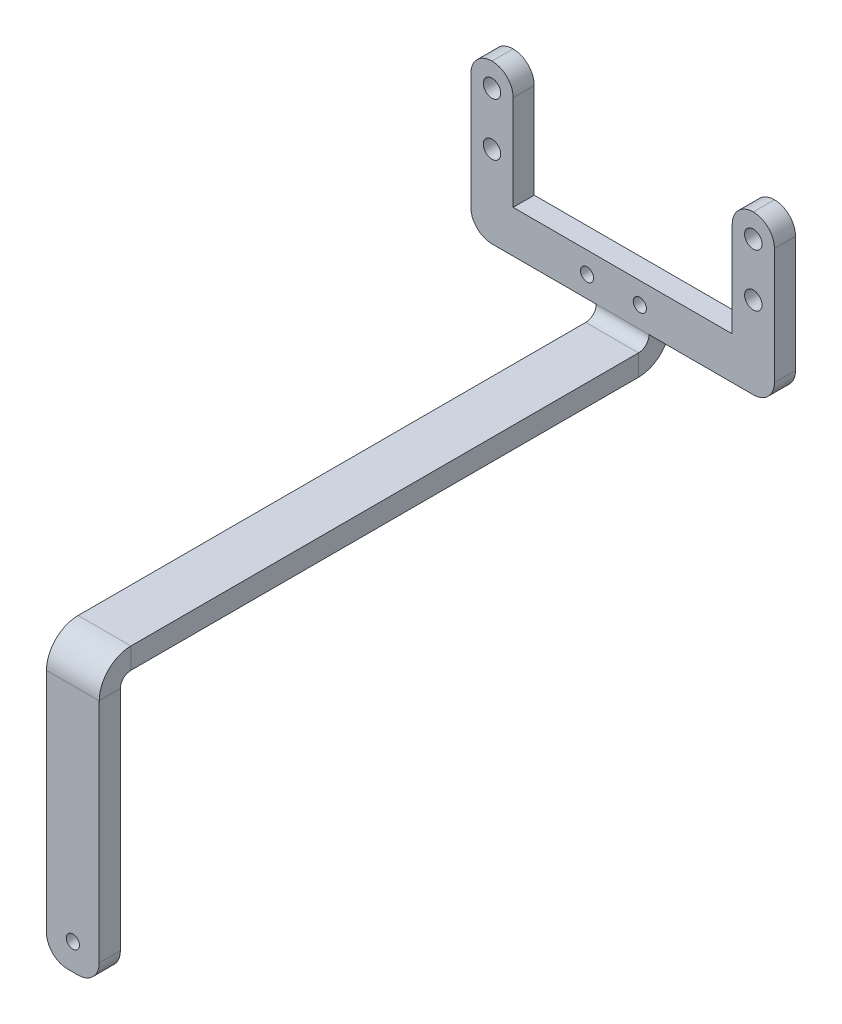
ISO-10303-21;
HEADER;
FILE_DESCRIPTION(('STEP AP214'),'2;1');
FILE_NAME('part.step','',(''),(''),'','','');
FILE_SCHEMA(('AUTOMOTIVE_DESIGN { 1 0 10303 214 1 1 1 1 }'));
ENDSEC;
DATA;
#1=APPLICATION_CONTEXT('core data for automotive mechanical design processes');
#2=APPLICATION_PROTOCOL_DEFINITION('international standard','automotive_design',2000,#1);
#3=PRODUCT_CONTEXT('',#1,'mechanical');
#4=PRODUCT('Part','Part','',(#3));
#5=PRODUCT_RELATED_PRODUCT_CATEGORY('part','',(#4));
#6=PRODUCT_DEFINITION_FORMATION('','',#4);
#7=PRODUCT_DEFINITION_CONTEXT('part definition',#1,'design');
#8=PRODUCT_DEFINITION('design','',#6,#7);
#9=PRODUCT_DEFINITION_SHAPE('','',#8);
#10=(LENGTH_UNIT() NAMED_UNIT(*) SI_UNIT(.MILLI.,.METRE.));
#11=(NAMED_UNIT(*) PLANE_ANGLE_UNIT() SI_UNIT($,.RADIAN.));
#12=(NAMED_UNIT(*) SI_UNIT($,.STERADIAN.) SOLID_ANGLE_UNIT());
#13=UNCERTAINTY_MEASURE_WITH_UNIT(LENGTH_MEASURE(1.E-05),#10,'distance_accuracy_value','');
#14=(GEOMETRIC_REPRESENTATION_CONTEXT(3) GLOBAL_UNCERTAINTY_ASSIGNED_CONTEXT((#13)) GLOBAL_UNIT_ASSIGNED_CONTEXT((#10,
#11,#12)) REPRESENTATION_CONTEXT('',''));
#15=CARTESIAN_POINT('',(0.,0.,0.));
#16=DIRECTION('',(0.,0.,1.));
#17=DIRECTION('',(1.,0.,0.));
#18=AXIS2_PLACEMENT_3D('',#15,#16,#17);
#19=CARTESIAN_POINT('',(23.75,-36.,3.99999999999999));
#20=DIRECTION('',(1.,0.,0.));
#21=DIRECTION('',(0.,0.,-1.));
#22=AXIS2_PLACEMENT_3D('',#19,#20,#21);
#23=PLANE('',#22);
#24=DIRECTION('',(0.,1.,0.));
#25=VECTOR('',#24,1.);
#26=CARTESIAN_POINT('',(23.75,-36.0000000000003,102.15));
#27=LINE('',#26,#25);
#28=CARTESIAN_POINT('',(23.75,-36.0000000000003,102.15));
#29=VERTEX_POINT('',#28);
#30=CARTESIAN_POINT('',(23.75,-32.0000000000003,102.15));
#31=VERTEX_POINT('',#30);
#32=EDGE_CURVE('E290',#29,#31,#27,.T.);
#33=ORIENTED_EDGE('',*,*,#32,.T.);
#34=DIRECTION('',(0.,0.,1.));
#35=VECTOR('',#34,1.);
#36=CARTESIAN_POINT('',(23.75,-32.,4.));
#37=LINE('',#36,#35);
#38=CARTESIAN_POINT('',(23.75,-32.,6.));
#39=VERTEX_POINT('',#38);
#40=EDGE_CURVE('E311',#31,#39,#37,.F.);
#41=ORIENTED_EDGE('',*,*,#40,.T.);
#42=DIRECTION('',(0.,1.,0.));
#43=VECTOR('',#42,1.);
#44=CARTESIAN_POINT('',(23.75,-36.,5.99999999999998));
#45=LINE('',#44,#43);
#46=CARTESIAN_POINT('',(23.75,-36.,5.99999999999998));
#47=VERTEX_POINT('',#46);
#48=EDGE_CURVE('E300',#39,#47,#45,.F.);
#49=ORIENTED_EDGE('',*,*,#48,.T.);
#50=DIRECTION('',(0.,0.,-1.));
#51=VECTOR('',#50,1.);
#52=CARTESIAN_POINT('',(23.75,-36.,-1.11778346024348E-13));
#53=LINE('',#52,#51);
#54=EDGE_CURVE('E306',#29,#47,#53,.T.);
#55=ORIENTED_EDGE('',*,*,#54,.F.);
#56=EDGE_LOOP('',(#33,#41,#49,#55));
#57=FACE_BOUND('',#56,.T.);
#58=ADVANCED_FACE('F77',(#57),#23,.F.);
#59=CARTESIAN_POINT('',(33.75,-36.0000000000004,108.15));
#60=DIRECTION('',(-1.,0.,0.));
#61=DIRECTION('',(0.,0.,1.));
#62=AXIS2_PLACEMENT_3D('',#59,#60,#61);
#63=PLANE('',#62);
#64=DIRECTION('',(0.,1.,0.));
#65=VECTOR('',#64,1.);
#66=CARTESIAN_POINT('',(33.75,-36.0000000000003,102.15));
#67=LINE('',#66,#65);
#68=CARTESIAN_POINT('',(33.75,-36.0000000000003,102.15));
#69=VERTEX_POINT('',#68);
#70=CARTESIAN_POINT('',(33.75,-32.0000000000003,102.15));
#71=VERTEX_POINT('',#70);
#72=EDGE_CURVE('E297',#69,#71,#67,.T.);
#73=ORIENTED_EDGE('',*,*,#72,.F.);
#74=DIRECTION('',(0.,0.,1.));
#75=VECTOR('',#74,1.);
#76=CARTESIAN_POINT('',(33.75,-36.,-1.14401667651485E-13));
#77=LINE('',#76,#75);
#78=CARTESIAN_POINT('',(33.75,-36.,5.99999999999999));
#79=VERTEX_POINT('',#78);
#80=EDGE_CURVE('E302',#79,#69,#77,.T.);
#81=ORIENTED_EDGE('',*,*,#80,.F.);
#82=DIRECTION('',(0.,1.,0.));
#83=VECTOR('',#82,1.);
#84=CARTESIAN_POINT('',(33.75,-32.,6.));
#85=LINE('',#84,#83);
#86=CARTESIAN_POINT('',(33.75,-32.,6.));
#87=VERTEX_POINT('',#86);
#88=EDGE_CURVE('E316',#87,#79,#85,.F.);
#89=ORIENTED_EDGE('',*,*,#88,.F.);
#90=DIRECTION('',(0.,0.,-1.));
#91=VECTOR('',#90,1.);
#92=CARTESIAN_POINT('',(33.75,-32.0000000000004,108.15));
#93=LINE('',#92,#91);
#94=EDGE_CURVE('E308',#87,#71,#93,.F.);
#95=ORIENTED_EDGE('',*,*,#94,.T.);
#96=EDGE_LOOP('',(#73,#81,#89,#95));
#97=FACE_BOUND('',#96,.T.);
#98=ADVANCED_FACE('F513',(#97),#63,.F.);
#99=CARTESIAN_POINT('',(0.,-36.,-1.18898790440863E-13));
#100=DIRECTION('',(0.,1.,0.));
#101=DIRECTION('',(0.,0.,1.));
#102=AXIS2_PLACEMENT_3D('',#99,#100,#101);
#103=PLANE('',#102);
#104=DIRECTION('',(-1.,0.,0.));
#105=VECTOR('',#104,1.);
#106=CARTESIAN_POINT('',(23.75,-36.0000000000003,102.15));
#107=LINE('',#106,#105);
#108=EDGE_CURVE('E294',#29,#69,#107,.F.);
#109=ORIENTED_EDGE('',*,*,#108,.F.);
#110=ORIENTED_EDGE('',*,*,#54,.T.);
#111=DIRECTION('',(1.,0.,0.));
#112=VECTOR('',#111,1.);
#113=CARTESIAN_POINT('',(23.75,-36.,5.99999999999998));
#114=LINE('',#113,#112);
#115=EDGE_CURVE('E313',#79,#47,#114,.F.);
#116=ORIENTED_EDGE('',*,*,#115,.F.);
#117=ORIENTED_EDGE('',*,*,#80,.T.);
#118=EDGE_LOOP('',(#109,#110,#116,#117));
#119=FACE_BOUND('',#118,.T.);
#120=ADVANCED_FACE('F508',(#119),#103,.F.);
#121=CARTESIAN_POINT('',(0.,-32.,-1.04932865085491E-13));
#122=DIRECTION('',(0.,1.,0.));
#123=DIRECTION('',(0.,0.,1.));
#124=AXIS2_PLACEMENT_3D('',#121,#122,#123);
#125=PLANE('',#124);
#126=ORIENTED_EDGE('',*,*,#40,.F.);
#127=DIRECTION('',(-1.,0.,0.));
#128=VECTOR('',#127,1.);
#129=CARTESIAN_POINT('',(23.75,-32.0000000000003,102.15));
#130=LINE('',#129,#128);
#131=EDGE_CURVE('E249',#31,#71,#130,.F.);
#132=ORIENTED_EDGE('',*,*,#131,.T.);
#133=ORIENTED_EDGE('',*,*,#94,.F.);
#134=DIRECTION('',(1.,0.,0.));
#135=VECTOR('',#134,1.);
#136=CARTESIAN_POINT('',(23.75,-32.,6.));
#137=LINE('',#136,#135);
#138=EDGE_CURVE('E319',#39,#87,#137,.T.);
#139=ORIENTED_EDGE('',*,*,#138,.F.);
#140=EDGE_LOOP('',(#126,#132,#133,#139));
#141=FACE_BOUND('',#140,.T.);
#142=ADVANCED_FACE('F521',(#141),#125,.T.);
#143=CARTESIAN_POINT('',(8.00000000000001,-30.,0.));
#144=DIRECTION('',(0.,-1.,0.));
#145=DIRECTION('',(1.,0.,0.));
#146=AXIS2_PLACEMENT_3D('',#143,#144,#145);
#147=PLANE('',#146);
#148=DIRECTION('',(1.,0.,0.));
#149=VECTOR('',#148,1.);
#150=CARTESIAN_POINT('',(8.00000000000001,-30.,0.));
#151=LINE('',#150,#149);
#152=CARTESIAN_POINT('',(33.75,-30.,0.));
#153=VERTEX_POINT('',#152);
#154=CARTESIAN_POINT('',(53.5,-30.,0.));
#155=VERTEX_POINT('',#154);
#156=EDGE_CURVE('E361',#153,#155,#151,.T.);
#157=ORIENTED_EDGE('',*,*,#156,.T.);
#158=DIRECTION('',(0.,0.,-1.));
#159=VECTOR('',#158,1.);
#160=CARTESIAN_POINT('',(53.5,-30.,0.));
#161=LINE('',#160,#159);
#162=CARTESIAN_POINT('',(53.5,-30.,4.));
#163=VERTEX_POINT('',#162);
#164=EDGE_CURVE('E421',#155,#163,#161,.F.);
#165=ORIENTED_EDGE('',*,*,#164,.T.);
#166=DIRECTION('',(1.,0.,0.));
#167=VECTOR('',#166,1.);
#168=CARTESIAN_POINT('',(0.,-30.,4.));
#169=LINE('',#168,#167);
#170=CARTESIAN_POINT('',(33.75,-30.,4.00000000000001));
#171=VERTEX_POINT('',#170);
#172=EDGE_CURVE('E369',#171,#163,#169,.T.);
#173=ORIENTED_EDGE('',*,*,#172,.F.);
#174=DIRECTION('',(0.,0.,-1.));
#175=VECTOR('',#174,1.);
#176=CARTESIAN_POINT('',(33.75,-30.,4.00000000000001));
#177=LINE('',#176,#175);
#178=EDGE_CURVE('E330',#171,#153,#177,.T.);
#179=ORIENTED_EDGE('',*,*,#178,.T.);
#180=EDGE_LOOP('',(#157,#165,#173,#179));
#181=FACE_BOUND('',#180,.T.);
#182=ADVANCED_FACE('F581',(#181),#147,.T.);
#183=CARTESIAN_POINT('',(8.,0.,0.));
#184=DIRECTION('',(1.,0.,0.));
#185=DIRECTION('',(0.,1.,0.));
#186=AXIS2_PLACEMENT_3D('',#183,#184,#185);
#187=PLANE('',#186);
#188=DIRECTION('',(0.,1.,0.));
#189=VECTOR('',#188,1.);
#190=CARTESIAN_POINT('',(8.,0.,0.));
#191=LINE('',#190,#189);
#192=CARTESIAN_POINT('',(8.00000000000001,-22.,0.));
#193=VERTEX_POINT('',#192);
#194=CARTESIAN_POINT('',(8.,-4.,0.));
#195=VERTEX_POINT('',#194);
#196=EDGE_CURVE('E349',#193,#195,#191,.T.);
#197=ORIENTED_EDGE('',*,*,#196,.T.);
#198=DIRECTION('',(0.,0.,-1.));
#199=VECTOR('',#198,1.);
#200=CARTESIAN_POINT('',(8.,-4.,0.));
#201=LINE('',#200,#199);
#202=CARTESIAN_POINT('',(8.00000000000001,-4.,4.));
#203=VERTEX_POINT('',#202);
#204=EDGE_CURVE('E425',#195,#203,#201,.F.);
#205=ORIENTED_EDGE('',*,*,#204,.T.);
#206=DIRECTION('',(0.,1.,0.));
#207=VECTOR('',#206,1.);
#208=CARTESIAN_POINT('',(8.00000000000001,0.,4.));
#209=LINE('',#208,#207);
#210=CARTESIAN_POINT('',(8.00000000000001,-22.,4.));
#211=VERTEX_POINT('',#210);
#212=EDGE_CURVE('E367',#211,#203,#209,.T.);
#213=ORIENTED_EDGE('',*,*,#212,.F.);
#214=DIRECTION('',(0.,0.,-1.));
#215=VECTOR('',#214,1.);
#216=CARTESIAN_POINT('',(8.00000000000001,-22.,0.));
#217=LINE('',#216,#215);
#218=EDGE_CURVE('E382',#211,#193,#217,.T.);
#219=ORIENTED_EDGE('',*,*,#218,.T.);
#220=EDGE_LOOP('',(#197,#205,#213,#219));
#221=FACE_BOUND('',#220,.T.);
#222=ADVANCED_FACE('F551',(#221),#187,.T.);
#223=CARTESIAN_POINT('',(8.00000000000001,-22.,0.));
#224=DIRECTION('',(0.,1.,0.));
#225=DIRECTION('',(-1.,0.,0.));
#226=AXIS2_PLACEMENT_3D('',#223,#224,#225);
#227=PLANE('',#226);
#228=ORIENTED_EDGE('',*,*,#218,.F.);
#229=DIRECTION('',(1.,0.,0.));
#230=VECTOR('',#229,1.);
#231=CARTESIAN_POINT('',(0.,-22.,4.));
#232=LINE('',#231,#230);
#233=CARTESIAN_POINT('',(49.5,-22.,4.));
#234=VERTEX_POINT('',#233);
#235=EDGE_CURVE('E375',#234,#211,#232,.F.);
#236=ORIENTED_EDGE('',*,*,#235,.F.);
#237=DIRECTION('',(0.,0.,-1.));
#238=VECTOR('',#237,1.);
#239=CARTESIAN_POINT('',(49.5,-22.,0.));
#240=LINE('',#239,#238);
#241=CARTESIAN_POINT('',(49.5,-22.,0.));
#242=VERTEX_POINT('',#241);
#243=EDGE_CURVE('E364',#234,#242,#240,.T.);
#244=ORIENTED_EDGE('',*,*,#243,.T.);
#245=DIRECTION('',(-1.,0.,0.));
#246=VECTOR('',#245,1.);
#247=CARTESIAN_POINT('',(8.00000000000001,-22.,0.));
#248=LINE('',#247,#246);
#249=EDGE_CURVE('E353',#242,#193,#248,.T.);
#250=ORIENTED_EDGE('',*,*,#249,.T.);
#251=EDGE_LOOP('',(#228,#236,#244,#250));
#252=FACE_BOUND('',#251,.T.);
#253=ADVANCED_FACE('F555',(#252),#227,.T.);
#254=CARTESIAN_POINT('',(49.5,-22.,0.));
#255=DIRECTION('',(-1.,0.,0.));
#256=DIRECTION('',(0.,-1.,0.));
#257=AXIS2_PLACEMENT_3D('',#254,#255,#256);
#258=PLANE('',#257);
#259=DIRECTION('',(0.,1.,0.));
#260=VECTOR('',#259,1.);
#261=CARTESIAN_POINT('',(49.5,0.,4.));
#262=LINE('',#261,#260);
#263=CARTESIAN_POINT('',(49.5,-4.,4.));
#264=VERTEX_POINT('',#263);
#265=EDGE_CURVE('E373',#264,#234,#262,.F.);
#266=ORIENTED_EDGE('',*,*,#265,.F.);
#267=DIRECTION('',(0.,0.,-1.));
#268=VECTOR('',#267,1.);
#269=CARTESIAN_POINT('',(49.5,-4.,0.));
#270=LINE('',#269,#268);
#271=CARTESIAN_POINT('',(49.5,-4.,0.));
#272=VERTEX_POINT('',#271);
#273=EDGE_CURVE('E423',#264,#272,#270,.T.);
#274=ORIENTED_EDGE('',*,*,#273,.T.);
#275=DIRECTION('',(0.,-1.,0.));
#276=VECTOR('',#275,1.);
#277=CARTESIAN_POINT('',(49.5,-22.,0.));
#278=LINE('',#277,#276);
#279=EDGE_CURVE('E356',#272,#242,#278,.T.);
#280=ORIENTED_EDGE('',*,*,#279,.T.);
#281=ORIENTED_EDGE('',*,*,#243,.F.);
#282=EDGE_LOOP('',(#266,#274,#280,#281));
#283=FACE_BOUND('',#282,.T.);
#284=ADVANCED_FACE('F561',(#283),#258,.T.);
#285=CARTESIAN_POINT('',(57.5,0.,0.));
#286=DIRECTION('',(1.,0.,0.));
#287=DIRECTION('',(0.,1.,0.));
#288=AXIS2_PLACEMENT_3D('',#285,#286,#287);
#289=PLANE('',#288);
#290=DIRECTION('',(0.,1.,0.));
#291=VECTOR('',#290,1.);
#292=CARTESIAN_POINT('',(57.5,0.,4.));
#293=LINE('',#292,#291);
#294=CARTESIAN_POINT('',(57.5,-26.,4.));
#295=VERTEX_POINT('',#294);
#296=CARTESIAN_POINT('',(57.5,-4.,4.));
#297=VERTEX_POINT('',#296);
#298=EDGE_CURVE('E370',#295,#297,#293,.T.);
#299=ORIENTED_EDGE('',*,*,#298,.F.);
#300=DIRECTION('',(0.,0.,-1.));
#301=VECTOR('',#300,1.);
#302=CARTESIAN_POINT('',(57.5,-26.,0.));
#303=LINE('',#302,#301);
#304=CARTESIAN_POINT('',(57.5,-26.,0.));
#305=VERTEX_POINT('',#304);
#306=EDGE_CURVE('E418',#295,#305,#303,.T.);
#307=ORIENTED_EDGE('',*,*,#306,.T.);
#308=DIRECTION('',(0.,1.,0.));
#309=VECTOR('',#308,1.);
#310=CARTESIAN_POINT('',(57.5,0.,0.));
#311=LINE('',#310,#309);
#312=CARTESIAN_POINT('',(57.5,-4.,0.));
#313=VERTEX_POINT('',#312);
#314=EDGE_CURVE('E358',#305,#313,#311,.T.);
#315=ORIENTED_EDGE('',*,*,#314,.T.);
#316=DIRECTION('',(0.,0.,-1.));
#317=VECTOR('',#316,1.);
#318=CARTESIAN_POINT('',(57.5,-4.,0.));
#319=LINE('',#318,#317);
#320=EDGE_CURVE('E415',#313,#297,#319,.F.);
#321=ORIENTED_EDGE('',*,*,#320,.T.);
#322=EDGE_LOOP('',(#299,#307,#315,#321));
#323=FACE_BOUND('',#322,.T.);
#324=ADVANCED_FACE('F574',(#323),#289,.T.);
#325=CARTESIAN_POINT('',(4.00000000000001,-30.,4.));
#326=VERTEX_POINT('',#325);
#327=CARTESIAN_POINT('',(23.75,-30.,4.));
#328=VERTEX_POINT('',#327);
#329=EDGE_CURVE('E350',#326,#328,#169,.T.);
#330=ORIENTED_EDGE('',*,*,#329,.F.);
#331=DIRECTION('',(0.,0.,-1.));
#332=VECTOR('',#331,1.);
#333=CARTESIAN_POINT('',(4.00000000000001,-30.,0.));
#334=LINE('',#333,#332);
#335=CARTESIAN_POINT('',(4.00000000000001,-30.,0.));
#336=VERTEX_POINT('',#335);
#337=EDGE_CURVE('E384',#326,#336,#334,.T.);
#338=ORIENTED_EDGE('',*,*,#337,.T.);
#339=CARTESIAN_POINT('',(23.75,-30.,0.));
#340=VERTEX_POINT('',#339);
#341=EDGE_CURVE('E362',#336,#340,#151,.T.);
#342=ORIENTED_EDGE('',*,*,#341,.T.);
#343=DIRECTION('',(0.,0.,-1.));
#344=VECTOR('',#343,1.);
#345=CARTESIAN_POINT('',(23.75,-30.,4.));
#346=LINE('',#345,#344);
#347=EDGE_CURVE('E340',#328,#340,#346,.T.);
#348=ORIENTED_EDGE('',*,*,#347,.F.);
#349=EDGE_LOOP('',(#330,#338,#342,#348));
#350=FACE_BOUND('',#349,.T.);
#351=ADVANCED_FACE('F495',(#350),#147,.T.);
#352=CARTESIAN_POINT('',(0.,0.,0.));
#353=DIRECTION('',(-1.,0.,0.));
#354=DIRECTION('',(0.,-1.,0.));
#355=AXIS2_PLACEMENT_3D('',#352,#353,#354);
#356=PLANE('',#355);
#357=DIRECTION('',(0.,-1.,0.));
#358=VECTOR('',#357,1.);
#359=CARTESIAN_POINT('',(0.,0.,0.));
#360=LINE('',#359,#358);
#361=CARTESIAN_POINT('',(0.,-4.,0.));
#362=VERTEX_POINT('',#361);
#363=CARTESIAN_POINT('',(0.,-26.,0.));
#364=VERTEX_POINT('',#363);
#365=EDGE_CURVE('E346',#362,#364,#360,.T.);
#366=ORIENTED_EDGE('',*,*,#365,.T.);
#367=DIRECTION('',(0.,0.,-1.));
#368=VECTOR('',#367,1.);
#369=CARTESIAN_POINT('',(0.,-26.,0.));
#370=LINE('',#369,#368);
#371=CARTESIAN_POINT('',(0.,-26.,4.));
#372=VERTEX_POINT('',#371);
#373=EDGE_CURVE('E401',#364,#372,#370,.F.);
#374=ORIENTED_EDGE('',*,*,#373,.T.);
#375=DIRECTION('',(0.,1.,0.));
#376=VECTOR('',#375,1.);
#377=CARTESIAN_POINT('',(0.,0.,4.));
#378=LINE('',#377,#376);
#379=CARTESIAN_POINT('',(0.,-4.,4.));
#380=VERTEX_POINT('',#379);
#381=EDGE_CURVE('E343',#380,#372,#378,.F.);
#382=ORIENTED_EDGE('',*,*,#381,.F.);
#383=DIRECTION('',(0.,0.,-1.));
#384=VECTOR('',#383,1.);
#385=CARTESIAN_POINT('',(0.,-4.,0.));
#386=LINE('',#385,#384);
#387=EDGE_CURVE('E399',#380,#362,#386,.T.);
#388=ORIENTED_EDGE('',*,*,#387,.T.);
#389=EDGE_LOOP('',(#366,#374,#382,#388));
#390=FACE_BOUND('',#389,.T.);
#391=ADVANCED_FACE('F485',(#390),#356,.T.);
#392=CARTESIAN_POINT('',(0.,0.,0.));
#393=DIRECTION('',(0.,0.,1.));
#394=DIRECTION('',(1.,0.,0.));
#395=AXIS2_PLACEMENT_3D('',#392,#393,#394);
#396=PLANE('',#395);
#397=CARTESIAN_POINT('',(22.,-26.,0.));
#398=DIRECTION('',(0.,0.,-1.));
#399=DIRECTION('',(-1.,0.,0.));
#400=AXIS2_PLACEMENT_3D('',#397,#398,#399);
#401=CIRCLE('',#400,1.24999999999999);
#402=CARTESIAN_POINT('',(20.75,-26.,0.));
#403=VERTEX_POINT('',#402);
#404=EDGE_CURVE('E1037',#403,#403,#401,.T.);
#405=ORIENTED_EDGE('',*,*,#404,.F.);
#406=EDGE_LOOP('',(#405));
#407=FACE_BOUND('',#406,.T.);
#408=CARTESIAN_POINT('',(32.,-26.,0.));
#409=DIRECTION('',(0.,0.,-1.));
#410=DIRECTION('',(-1.,0.,0.));
#411=AXIS2_PLACEMENT_3D('',#408,#409,#410);
#412=CIRCLE('',#411,1.24999999999999);
#413=CARTESIAN_POINT('',(30.75,-26.,0.));
#414=VERTEX_POINT('',#413);
#415=EDGE_CURVE('E1039',#414,#414,#412,.T.);
#416=ORIENTED_EDGE('',*,*,#415,.F.);
#417=EDGE_LOOP('',(#416));
#418=FACE_BOUND('',#417,.T.);
#419=CARTESIAN_POINT('',(53.5,-4.45,0.));
#420=DIRECTION('',(0.,0.,-1.));
#421=DIRECTION('',(-1.,0.,0.));
#422=AXIS2_PLACEMENT_3D('',#419,#420,#421);
#423=CIRCLE('',#422,1.64999999999999);
#424=CARTESIAN_POINT('',(51.85,-4.45,0.));
#425=VERTEX_POINT('',#424);
#426=EDGE_CURVE('E457',#425,#425,#423,.T.);
#427=ORIENTED_EDGE('',*,*,#426,.F.);
#428=EDGE_LOOP('',(#427));
#429=FACE_BOUND('',#428,.T.);
#430=CARTESIAN_POINT('',(53.5,-14.45,0.));
#431=DIRECTION('',(0.,0.,-1.));
#432=DIRECTION('',(-1.,0.,0.));
#433=AXIS2_PLACEMENT_3D('',#430,#431,#432);
#434=CIRCLE('',#433,1.64999999999999);
#435=CARTESIAN_POINT('',(51.85,-14.45,0.));
#436=VERTEX_POINT('',#435);
#437=EDGE_CURVE('E454',#436,#436,#434,.T.);
#438=ORIENTED_EDGE('',*,*,#437,.F.);
#439=EDGE_LOOP('',(#438));
#440=FACE_BOUND('',#439,.T.);
#441=CARTESIAN_POINT('',(4.,-14.45,0.));
#442=DIRECTION('',(0.,0.,-1.));
#443=DIRECTION('',(-1.,0.,0.));
#444=AXIS2_PLACEMENT_3D('',#441,#442,#443);
#445=CIRCLE('',#444,1.64999999999999);
#446=CARTESIAN_POINT('',(2.35000000000001,-14.45,0.));
#447=VERTEX_POINT('',#446);
#448=EDGE_CURVE('E453',#447,#447,#445,.T.);
#449=ORIENTED_EDGE('',*,*,#448,.F.);
#450=EDGE_LOOP('',(#449));
#451=FACE_BOUND('',#450,.T.);
#452=CARTESIAN_POINT('',(4.,-4.45,0.));
#453=DIRECTION('',(0.,0.,-1.));
#454=DIRECTION('',(-1.,0.,0.));
#455=AXIS2_PLACEMENT_3D('',#452,#453,#454);
#456=CIRCLE('',#455,1.64999999999999);
#457=CARTESIAN_POINT('',(2.35000000000001,-4.45,0.));
#458=VERTEX_POINT('',#457);
#459=EDGE_CURVE('E450',#458,#458,#456,.T.);
#460=ORIENTED_EDGE('',*,*,#459,.F.);
#461=EDGE_LOOP('',(#460));
#462=FACE_BOUND('',#461,.T.);
#463=ORIENTED_EDGE('',*,*,#341,.F.);
#464=CARTESIAN_POINT('',(4.00000000000001,-26.,0.));
#465=DIRECTION('',(0.,0.,1.));
#466=DIRECTION('',(1.,0.,0.));
#467=AXIS2_PLACEMENT_3D('',#464,#465,#466);
#468=CIRCLE('',#467,4.);
#469=EDGE_CURVE('E397',#336,#364,#468,.F.);
#470=ORIENTED_EDGE('',*,*,#469,.T.);
#471=ORIENTED_EDGE('',*,*,#365,.F.);
#472=CARTESIAN_POINT('',(4.,-4.,0.));
#473=DIRECTION('',(0.,0.,1.));
#474=DIRECTION('',(1.,0.,0.));
#475=AXIS2_PLACEMENT_3D('',#472,#473,#474);
#476=CIRCLE('',#475,4.);
#477=CARTESIAN_POINT('',(4.,0.,0.));
#478=VERTEX_POINT('',#477);
#479=EDGE_CURVE('E387',#362,#478,#476,.F.);
#480=ORIENTED_EDGE('',*,*,#479,.T.);
#481=CARTESIAN_POINT('',(4.,-4.,0.));
#482=DIRECTION('',(0.,0.,1.));
#483=DIRECTION('',(1.,0.,0.));
#484=AXIS2_PLACEMENT_3D('',#481,#482,#483);
#485=CIRCLE('',#484,4.);
#486=EDGE_CURVE('E389',#478,#195,#485,.F.);
#487=ORIENTED_EDGE('',*,*,#486,.T.);
#488=ORIENTED_EDGE('',*,*,#196,.F.);
#489=ORIENTED_EDGE('',*,*,#249,.F.);
#490=ORIENTED_EDGE('',*,*,#279,.F.);
#491=CARTESIAN_POINT('',(53.5,-4.,0.));
#492=DIRECTION('',(0.,0.,1.));
#493=DIRECTION('',(1.,0.,0.));
#494=AXIS2_PLACEMENT_3D('',#491,#492,#493);
#495=CIRCLE('',#494,4.);
#496=CARTESIAN_POINT('',(53.5,0.,0.));
#497=VERTEX_POINT('',#496);
#498=EDGE_CURVE('E391',#272,#497,#495,.F.);
#499=ORIENTED_EDGE('',*,*,#498,.T.);
#500=CARTESIAN_POINT('',(53.5,-4.,0.));
#501=DIRECTION('',(0.,0.,1.));
#502=DIRECTION('',(1.,0.,0.));
#503=AXIS2_PLACEMENT_3D('',#500,#501,#502);
#504=CIRCLE('',#503,4.);
#505=EDGE_CURVE('E393',#497,#313,#504,.F.);
#506=ORIENTED_EDGE('',*,*,#505,.T.);
#507=ORIENTED_EDGE('',*,*,#314,.F.);
#508=CARTESIAN_POINT('',(53.5,-26.,0.));
#509=DIRECTION('',(0.,0.,1.));
#510=DIRECTION('',(1.,0.,0.));
#511=AXIS2_PLACEMENT_3D('',#508,#509,#510);
#512=CIRCLE('',#511,4.);
#513=EDGE_CURVE('E395',#305,#155,#512,.F.);
#514=ORIENTED_EDGE('',*,*,#513,.T.);
#515=ORIENTED_EDGE('',*,*,#156,.F.);
#516=DIRECTION('',(1.,0.,0.));
#517=VECTOR('',#516,1.);
#518=CARTESIAN_POINT('',(33.75,-30.,0.));
#519=LINE('',#518,#517);
#520=EDGE_CURVE('E323',#153,#340,#519,.F.);
#521=ORIENTED_EDGE('',*,*,#520,.T.);
#522=EDGE_LOOP('',(#463,#470,#471,#480,#487,#488,#489,#490,#499,#506,#507,#514,#515,#521));
#523=FACE_BOUND('',#522,.T.);
#524=ADVANCED_FACE('F481',(#407,#418,#429,#440,#451,#462,#523),#396,.F.);
#525=CARTESIAN_POINT('',(0.,0.,4.));
#526=DIRECTION('',(0.,0.,1.));
#527=DIRECTION('',(1.,0.,0.));
#528=AXIS2_PLACEMENT_3D('',#525,#526,#527);
#529=PLANE('',#528);
#530=CARTESIAN_POINT('',(22.,-26.,4.));
#531=DIRECTION('',(0.,0.,1.));
#532=DIRECTION('',(1.,0.,0.));
#533=AXIS2_PLACEMENT_3D('',#530,#531,#532);
#534=CIRCLE('',#533,1.24999999999998);
#535=CARTESIAN_POINT('',(23.25,-26.,4.));
#536=VERTEX_POINT('',#535);
#537=EDGE_CURVE('E1034',#536,#536,#534,.T.);
#538=ORIENTED_EDGE('',*,*,#537,.F.);
#539=EDGE_LOOP('',(#538));
#540=FACE_BOUND('',#539,.T.);
#541=CARTESIAN_POINT('',(32.,-26.,4.));
#542=DIRECTION('',(0.,0.,1.));
#543=DIRECTION('',(1.,0.,0.));
#544=AXIS2_PLACEMENT_3D('',#541,#542,#543);
#545=CIRCLE('',#544,1.24999999999998);
#546=CARTESIAN_POINT('',(33.25,-26.,4.));
#547=VERTEX_POINT('',#546);
#548=EDGE_CURVE('E81',#547,#547,#545,.T.);
#549=ORIENTED_EDGE('',*,*,#548,.F.);
#550=EDGE_LOOP('',(#549));
#551=FACE_BOUND('',#550,.T.);
#552=CARTESIAN_POINT('',(53.5,-4.45,4.));
#553=DIRECTION('',(0.,0.,1.));
#554=DIRECTION('',(1.,0.,0.));
#555=AXIS2_PLACEMENT_3D('',#552,#553,#554);
#556=CIRCLE('',#555,1.64999999999998);
#557=CARTESIAN_POINT('',(55.15,-4.45,4.));
#558=VERTEX_POINT('',#557);
#559=EDGE_CURVE('E455',#558,#558,#556,.T.);
#560=ORIENTED_EDGE('',*,*,#559,.F.);
#561=EDGE_LOOP('',(#560));
#562=FACE_BOUND('',#561,.T.);
#563=CARTESIAN_POINT('',(53.5,-14.45,4.));
#564=DIRECTION('',(0.,0.,1.));
#565=DIRECTION('',(1.,0.,0.));
#566=AXIS2_PLACEMENT_3D('',#563,#564,#565);
#567=CIRCLE('',#566,1.64999999999998);
#568=CARTESIAN_POINT('',(55.15,-14.45,4.));
#569=VERTEX_POINT('',#568);
#570=EDGE_CURVE('E451',#569,#569,#567,.T.);
#571=ORIENTED_EDGE('',*,*,#570,.F.);
#572=EDGE_LOOP('',(#571));
#573=FACE_BOUND('',#572,.T.);
#574=CARTESIAN_POINT('',(4.,-14.45,4.));
#575=DIRECTION('',(0.,0.,1.));
#576=DIRECTION('',(1.,0.,0.));
#577=AXIS2_PLACEMENT_3D('',#574,#575,#576);
#578=CIRCLE('',#577,1.64999999999998);
#579=CARTESIAN_POINT('',(5.64999999999998,-14.45,4.));
#580=VERTEX_POINT('',#579);
#581=EDGE_CURVE('E474',#580,#580,#578,.T.);
#582=ORIENTED_EDGE('',*,*,#581,.F.);
#583=EDGE_LOOP('',(#582));
#584=FACE_BOUND('',#583,.T.);
#585=CARTESIAN_POINT('',(4.,-4.45,4.));
#586=DIRECTION('',(0.,0.,1.));
#587=DIRECTION('',(1.,0.,0.));
#588=AXIS2_PLACEMENT_3D('',#585,#586,#587);
#589=CIRCLE('',#588,1.64999999999998);
#590=CARTESIAN_POINT('',(5.64999999999999,-4.45,4.));
#591=VERTEX_POINT('',#590);
#592=EDGE_CURVE('E447',#591,#591,#589,.T.);
#593=ORIENTED_EDGE('',*,*,#592,.F.);
#594=EDGE_LOOP('',(#593));
#595=FACE_BOUND('',#594,.T.);
#596=ORIENTED_EDGE('',*,*,#381,.T.);
#597=CARTESIAN_POINT('',(4.00000000000001,-26.,4.));
#598=DIRECTION('',(0.,0.,1.));
#599=DIRECTION('',(1.,0.,0.));
#600=AXIS2_PLACEMENT_3D('',#597,#598,#599);
#601=CIRCLE('',#600,4.);
#602=EDGE_CURVE('E413',#372,#326,#601,.T.);
#603=ORIENTED_EDGE('',*,*,#602,.T.);
#604=ORIENTED_EDGE('',*,*,#329,.T.);
#605=DIRECTION('',(1.,0.,0.));
#606=VECTOR('',#605,1.);
#607=CARTESIAN_POINT('',(33.75,-30.,4.00000000000001));
#608=LINE('',#607,#606);
#609=EDGE_CURVE('E335',#171,#328,#608,.F.);
#610=ORIENTED_EDGE('',*,*,#609,.F.);
#611=ORIENTED_EDGE('',*,*,#172,.T.);
#612=CARTESIAN_POINT('',(53.5,-26.,4.));
#613=DIRECTION('',(0.,0.,1.));
#614=DIRECTION('',(1.,0.,0.));
#615=AXIS2_PLACEMENT_3D('',#612,#613,#614);
#616=CIRCLE('',#615,4.);
#617=EDGE_CURVE('E411',#163,#295,#616,.T.);
#618=ORIENTED_EDGE('',*,*,#617,.T.);
#619=ORIENTED_EDGE('',*,*,#298,.T.);
#620=CARTESIAN_POINT('',(53.5,-4.,4.));
#621=DIRECTION('',(0.,0.,1.));
#622=DIRECTION('',(1.,0.,0.));
#623=AXIS2_PLACEMENT_3D('',#620,#621,#622);
#624=CIRCLE('',#623,4.);
#625=CARTESIAN_POINT('',(53.5,0.,4.));
#626=VERTEX_POINT('',#625);
#627=EDGE_CURVE('E409',#297,#626,#624,.T.);
#628=ORIENTED_EDGE('',*,*,#627,.T.);
#629=CARTESIAN_POINT('',(53.5,-4.,4.));
#630=DIRECTION('',(0.,0.,1.));
#631=DIRECTION('',(1.,0.,0.));
#632=AXIS2_PLACEMENT_3D('',#629,#630,#631);
#633=CIRCLE('',#632,4.);
#634=EDGE_CURVE('E407',#626,#264,#633,.T.);
#635=ORIENTED_EDGE('',*,*,#634,.T.);
#636=ORIENTED_EDGE('',*,*,#265,.T.);
#637=ORIENTED_EDGE('',*,*,#235,.T.);
#638=ORIENTED_EDGE('',*,*,#212,.T.);
#639=CARTESIAN_POINT('',(4.,-4.,4.));
#640=DIRECTION('',(0.,0.,1.));
#641=DIRECTION('',(1.,0.,0.));
#642=AXIS2_PLACEMENT_3D('',#639,#640,#641);
#643=CIRCLE('',#642,4.);
#644=CARTESIAN_POINT('',(4.,0.,4.));
#645=VERTEX_POINT('',#644);
#646=EDGE_CURVE('E405',#203,#645,#643,.T.);
#647=ORIENTED_EDGE('',*,*,#646,.T.);
#648=CARTESIAN_POINT('',(4.,-4.,4.));
#649=DIRECTION('',(0.,0.,1.));
#650=DIRECTION('',(1.,0.,0.));
#651=AXIS2_PLACEMENT_3D('',#648,#649,#650);
#652=CIRCLE('',#651,4.);
#653=EDGE_CURVE('E403',#645,#380,#652,.T.);
#654=ORIENTED_EDGE('',*,*,#653,.T.);
#655=EDGE_LOOP('',(#596,#603,#604,#610,#611,#618,#619,#628,#635,#636,#637,#638,#647,#654));
#656=FACE_BOUND('',#655,.T.);
#657=ADVANCED_FACE('F484',(#540,#551,#562,#573,#584,#595,#656),#529,.T.);
#658=CARTESIAN_POINT('',(23.75,-30.,6.));
#659=DIRECTION('',(-1.,0.,0.));
#660=DIRECTION('',(0.,0.,1.));
#661=AXIS2_PLACEMENT_3D('',#658,#659,#660);
#662=PLANE('',#661);
#663=ORIENTED_EDGE('',*,*,#48,.F.);
#664=CARTESIAN_POINT('',(23.75,-30.,6.));
#665=DIRECTION('',(1.,0.,0.));
#666=DIRECTION('',(0.,0.,-1.));
#667=AXIS2_PLACEMENT_3D('',#664,#665,#666);
#668=CIRCLE('',#667,2.);
#669=EDGE_CURVE('E332',#328,#39,#668,.F.);
#670=ORIENTED_EDGE('',*,*,#669,.F.);
#671=ORIENTED_EDGE('',*,*,#347,.T.);
#672=CARTESIAN_POINT('',(23.75,-30.,6.));
#673=DIRECTION('',(1.,0.,0.));
#674=DIRECTION('',(0.,0.,-1.));
#675=AXIS2_PLACEMENT_3D('',#672,#673,#674);
#676=CIRCLE('',#675,6.);
#677=EDGE_CURVE('E326',#340,#47,#676,.F.);
#678=ORIENTED_EDGE('',*,*,#677,.T.);
#679=EDGE_LOOP('',(#663,#670,#671,#678));
#680=FACE_BOUND('',#679,.T.);
#681=ADVANCED_FACE('F501',(#680),#662,.T.);
#682=CARTESIAN_POINT('',(33.75,-30.,6.00000000000001));
#683=DIRECTION('',(-1.,0.,0.));
#684=DIRECTION('',(0.,0.,1.));
#685=AXIS2_PLACEMENT_3D('',#682,#683,#684);
#686=PLANE('',#685);
#687=CARTESIAN_POINT('',(33.75,-30.,6.00000000000001));
#688=DIRECTION('',(1.,0.,0.));
#689=DIRECTION('',(0.,0.,-1.));
#690=AXIS2_PLACEMENT_3D('',#687,#688,#689);
#691=CIRCLE('',#690,2.);
#692=EDGE_CURVE('E305',#87,#171,#691,.T.);
#693=ORIENTED_EDGE('',*,*,#692,.F.);
#694=ORIENTED_EDGE('',*,*,#88,.T.);
#695=CARTESIAN_POINT('',(33.75,-30.,6.00000000000001));
#696=DIRECTION('',(1.,0.,0.));
#697=DIRECTION('',(0.,0.,-1.));
#698=AXIS2_PLACEMENT_3D('',#695,#696,#697);
#699=CIRCLE('',#698,6.);
#700=EDGE_CURVE('E327',#79,#153,#699,.T.);
#701=ORIENTED_EDGE('',*,*,#700,.T.);
#702=ORIENTED_EDGE('',*,*,#178,.F.);
#703=EDGE_LOOP('',(#693,#694,#701,#702));
#704=FACE_BOUND('',#703,.T.);
#705=ADVANCED_FACE('F583',(#704),#686,.F.);
#706=CARTESIAN_POINT('',(33.75,-30.,6.00000000000001));
#707=DIRECTION('',(1.,0.,0.));
#708=DIRECTION('',(0.,-1.,0.));
#709=AXIS2_PLACEMENT_3D('',#706,#707,#708);
#710=CYLINDRICAL_SURFACE('',#709,6.);
#711=ORIENTED_EDGE('',*,*,#520,.F.);
#712=ORIENTED_EDGE('',*,*,#700,.F.);
#713=ORIENTED_EDGE('',*,*,#115,.T.);
#714=ORIENTED_EDGE('',*,*,#677,.F.);
#715=EDGE_LOOP('',(#711,#712,#713,#714));
#716=FACE_BOUND('',#715,.T.);
#717=ADVANCED_FACE('F503',(#716),#710,.T.);
#718=CARTESIAN_POINT('',(33.75,-30.,6.00000000000001));
#719=DIRECTION('',(1.,0.,0.));
#720=DIRECTION('',(0.,-1.,0.));
#721=AXIS2_PLACEMENT_3D('',#718,#719,#720);
#722=CYLINDRICAL_SURFACE('',#721,2.);
#723=ORIENTED_EDGE('',*,*,#609,.T.);
#724=ORIENTED_EDGE('',*,*,#669,.T.);
#725=ORIENTED_EDGE('',*,*,#138,.T.);
#726=ORIENTED_EDGE('',*,*,#692,.T.);
#727=EDGE_LOOP('',(#723,#724,#725,#726));
#728=FACE_BOUND('',#727,.T.);
#729=ADVANCED_FACE('F525',(#728),#722,.F.);
#730=CARTESIAN_POINT('',(33.75,-38.0000000000003,102.15));
#731=DIRECTION('',(1.,0.,0.));
#732=DIRECTION('',(0.,0.,-1.));
#733=AXIS2_PLACEMENT_3D('',#730,#731,#732);
#734=PLANE('',#733);
#735=DIRECTION('',(0.,0.,-1.));
#736=VECTOR('',#735,1.);
#737=CARTESIAN_POINT('',(33.75,-38.0000000000003,108.15));
#738=LINE('',#737,#736);
#739=CARTESIAN_POINT('',(33.75,-38.0000000000003,104.15));
#740=VERTEX_POINT('',#739);
#741=CARTESIAN_POINT('',(33.75,-38.0000000000003,108.15));
#742=VERTEX_POINT('',#741);
#743=EDGE_CURVE('E284',#740,#742,#738,.F.);
#744=ORIENTED_EDGE('',*,*,#743,.F.);
#745=CARTESIAN_POINT('',(33.75,-38.0000000000003,102.15));
#746=DIRECTION('',(-1.,0.,0.));
#747=DIRECTION('',(0.,0.,1.));
#748=AXIS2_PLACEMENT_3D('',#745,#746,#747);
#749=CIRCLE('',#748,1.99999999999999);
#750=EDGE_CURVE('E252',#69,#740,#749,.F.);
#751=ORIENTED_EDGE('',*,*,#750,.F.);
#752=ORIENTED_EDGE('',*,*,#72,.T.);
#753=CARTESIAN_POINT('',(33.75,-38.0000000000003,102.15));
#754=DIRECTION('',(-1.,0.,0.));
#755=DIRECTION('',(0.,0.,1.));
#756=AXIS2_PLACEMENT_3D('',#753,#754,#755);
#757=CIRCLE('',#756,5.99999999999999);
#758=EDGE_CURVE('E289',#71,#742,#757,.F.);
#759=ORIENTED_EDGE('',*,*,#758,.T.);
#760=EDGE_LOOP('',(#744,#751,#752,#759));
#761=FACE_BOUND('',#760,.T.);
#762=ADVANCED_FACE('F518',(#761),#734,.T.);
#763=CARTESIAN_POINT('',(23.75,-38.0000000000003,102.15));
#764=DIRECTION('',(1.,0.,0.));
#765=DIRECTION('',(0.,0.,-1.));
#766=AXIS2_PLACEMENT_3D('',#763,#764,#765);
#767=PLANE('',#766);
#768=CARTESIAN_POINT('',(23.75,-38.0000000000003,102.15));
#769=DIRECTION('',(-1.,0.,0.));
#770=DIRECTION('',(0.,0.,1.));
#771=AXIS2_PLACEMENT_3D('',#768,#769,#770);
#772=CIRCLE('',#771,1.99999999999999);
#773=CARTESIAN_POINT('',(23.75,-38.0000000000003,104.15));
#774=VERTEX_POINT('',#773);
#775=EDGE_CURVE('E259',#774,#29,#772,.T.);
#776=ORIENTED_EDGE('',*,*,#775,.F.);
#777=DIRECTION('',(0.,0.,-1.));
#778=VECTOR('',#777,1.);
#779=CARTESIAN_POINT('',(23.75,-38.0000000000003,104.15));
#780=LINE('',#779,#778);
#781=CARTESIAN_POINT('',(23.75,-38.0000000000003,108.15));
#782=VERTEX_POINT('',#781);
#783=EDGE_CURVE('E256',#774,#782,#780,.F.);
#784=ORIENTED_EDGE('',*,*,#783,.T.);
#785=CARTESIAN_POINT('',(23.75,-38.0000000000003,102.15));
#786=DIRECTION('',(-1.,0.,0.));
#787=DIRECTION('',(0.,0.,1.));
#788=AXIS2_PLACEMENT_3D('',#785,#786,#787);
#789=CIRCLE('',#788,5.99999999999999);
#790=EDGE_CURVE('E242',#782,#31,#789,.T.);
#791=ORIENTED_EDGE('',*,*,#790,.T.);
#792=ORIENTED_EDGE('',*,*,#32,.F.);
#793=EDGE_LOOP('',(#776,#784,#791,#792));
#794=FACE_BOUND('',#793,.T.);
#795=ADVANCED_FACE('F257',(#794),#767,.F.);
#796=CARTESIAN_POINT('',(23.75,-38.0000000000003,102.15));
#797=DIRECTION('',(-1.,0.,0.));
#798=DIRECTION('',(0.,0.,1.));
#799=AXIS2_PLACEMENT_3D('',#796,#797,#798);
#800=CYLINDRICAL_SURFACE('',#799,5.99999999999999);
#801=ORIENTED_EDGE('',*,*,#131,.F.);
#802=ORIENTED_EDGE('',*,*,#790,.F.);
#803=DIRECTION('',(-1.,0.,0.));
#804=VECTOR('',#803,1.);
#805=CARTESIAN_POINT('',(33.75,-38.0000000000003,108.15));
#806=LINE('',#805,#804);
#807=EDGE_CURVE('E246',#782,#742,#806,.F.);
#808=ORIENTED_EDGE('',*,*,#807,.T.);
#809=ORIENTED_EDGE('',*,*,#758,.F.);
#810=EDGE_LOOP('',(#801,#802,#808,#809));
#811=FACE_BOUND('',#810,.T.);
#812=ADVANCED_FACE('F244',(#811),#800,.T.);
#813=CARTESIAN_POINT('',(23.75,-38.0000000000003,102.15));
#814=DIRECTION('',(-1.,0.,0.));
#815=DIRECTION('',(0.,0.,1.));
#816=AXIS2_PLACEMENT_3D('',#813,#814,#815);
#817=CYLINDRICAL_SURFACE('',#816,1.99999999999999);
#818=ORIENTED_EDGE('',*,*,#108,.T.);
#819=ORIENTED_EDGE('',*,*,#750,.T.);
#820=DIRECTION('',(-1.,0.,0.));
#821=VECTOR('',#820,1.);
#822=CARTESIAN_POINT('',(33.75,-38.0000000000003,104.15));
#823=LINE('',#822,#821);
#824=EDGE_CURVE('E261',#740,#774,#823,.T.);
#825=ORIENTED_EDGE('',*,*,#824,.T.);
#826=ORIENTED_EDGE('',*,*,#775,.T.);
#827=EDGE_LOOP('',(#818,#819,#825,#826));
#828=FACE_BOUND('',#827,.T.);
#829=ADVANCED_FACE('F610',(#828),#817,.F.);
#830=CARTESIAN_POINT('',(33.75,-36.0000000000003,108.15));
#831=DIRECTION('',(-1.,0.,0.));
#832=DIRECTION('',(0.,0.,1.));
#833=AXIS2_PLACEMENT_3D('',#830,#831,#832);
#834=PLANE('',#833);
#835=DIRECTION('',(0.,1.,0.));
#836=VECTOR('',#835,1.);
#837=CARTESIAN_POINT('',(33.75,0.,108.15));
#838=LINE('',#837,#836);
#839=CARTESIAN_POINT('',(33.75,-81.0000000000004,108.15));
#840=VERTEX_POINT('',#839);
#841=EDGE_CURVE('E268',#840,#742,#838,.T.);
#842=ORIENTED_EDGE('',*,*,#841,.F.);
#843=DIRECTION('',(0.,0.,-1.));
#844=VECTOR('',#843,1.);
#845=CARTESIAN_POINT('',(33.75,-81.0000000000004,108.15));
#846=LINE('',#845,#844);
#847=CARTESIAN_POINT('',(33.75,-81.0000000000004,104.15));
#848=VERTEX_POINT('',#847);
#849=EDGE_CURVE('E428',#840,#848,#846,.T.);
#850=ORIENTED_EDGE('',*,*,#849,.T.);
#851=DIRECTION('',(0.,-1.,0.));
#852=VECTOR('',#851,1.);
#853=CARTESIAN_POINT('',(33.75,-36.0000000000003,104.15));
#854=LINE('',#853,#852);
#855=EDGE_CURVE('E269',#848,#740,#854,.F.);
#856=ORIENTED_EDGE('',*,*,#855,.T.);
#857=ORIENTED_EDGE('',*,*,#743,.T.);
#858=EDGE_LOOP('',(#842,#850,#856,#857));
#859=FACE_BOUND('',#858,.T.);
#860=ADVANCED_FACE('F659',(#859),#834,.F.);
#861=CARTESIAN_POINT('',(23.75,-85.0000000000004,108.15));
#862=DIRECTION('',(1.,0.,0.));
#863=DIRECTION('',(0.,1.,0.));
#864=AXIS2_PLACEMENT_3D('',#861,#862,#863);
#865=PLANE('',#864);
#866=DIRECTION('',(0.,1.,0.));
#867=VECTOR('',#866,1.);
#868=CARTESIAN_POINT('',(23.75,-85.0000000000004,104.15));
#869=LINE('',#868,#867);
#870=CARTESIAN_POINT('',(23.75,-81.0000000000004,104.15));
#871=VERTEX_POINT('',#870);
#872=EDGE_CURVE('E280',#774,#871,#869,.F.);
#873=ORIENTED_EDGE('',*,*,#872,.T.);
#874=DIRECTION('',(0.,0.,-1.));
#875=VECTOR('',#874,1.);
#876=CARTESIAN_POINT('',(23.75,-81.0000000000004,108.15));
#877=LINE('',#876,#875);
#878=CARTESIAN_POINT('',(23.75,-81.0000000000004,108.15));
#879=VERTEX_POINT('',#878);
#880=EDGE_CURVE('E13',#871,#879,#877,.F.);
#881=ORIENTED_EDGE('',*,*,#880,.T.);
#882=DIRECTION('',(0.,-1.,0.));
#883=VECTOR('',#882,1.);
#884=CARTESIAN_POINT('',(23.75,0.,108.15));
#885=LINE('',#884,#883);
#886=EDGE_CURVE('E265',#782,#879,#885,.T.);
#887=ORIENTED_EDGE('',*,*,#886,.F.);
#888=ORIENTED_EDGE('',*,*,#783,.F.);
#889=EDGE_LOOP('',(#873,#881,#887,#888));
#890=FACE_BOUND('',#889,.T.);
#891=ADVANCED_FACE('F271',(#890),#865,.F.);
#892=CARTESIAN_POINT('',(0.,0.,108.15));
#893=DIRECTION('',(0.,0.,-1.));
#894=DIRECTION('',(-1.,0.,0.));
#895=AXIS2_PLACEMENT_3D('',#892,#893,#894);
#896=PLANE('',#895);
#897=CARTESIAN_POINT('',(28.75,-80.0000000000004,108.15));
#898=DIRECTION('',(0.,0.,-1.));
#899=DIRECTION('',(-1.,0.,0.));
#900=AXIS2_PLACEMENT_3D('',#897,#898,#899);
#901=CIRCLE('',#900,1.24999999999999);
#902=CARTESIAN_POINT('',(27.5,-80.0000000000004,108.15));
#903=VERTEX_POINT('',#902);
#904=EDGE_CURVE('E463',#903,#903,#901,.T.);
#905=ORIENTED_EDGE('',*,*,#904,.T.);
#906=EDGE_LOOP('',(#905));
#907=FACE_BOUND('',#906,.T.);
#908=DIRECTION('',(1.,0.,0.));
#909=VECTOR('',#908,1.);
#910=CARTESIAN_POINT('',(0.,-85.0000000000004,108.15));
#911=LINE('',#910,#909);
#912=CARTESIAN_POINT('',(27.75,-85.0000000000004,108.15));
#913=VERTEX_POINT('',#912);
#914=CARTESIAN_POINT('',(29.75,-85.0000000000004,108.15));
#915=VERTEX_POINT('',#914);
#916=EDGE_CURVE('E272',#913,#915,#911,.T.);
#917=ORIENTED_EDGE('',*,*,#916,.T.);
#918=CARTESIAN_POINT('',(29.75,-81.0000000000004,108.15));
#919=DIRECTION('',(0.,0.,-1.));
#920=DIRECTION('',(-1.,0.,0.));
#921=AXIS2_PLACEMENT_3D('',#918,#919,#920);
#922=CIRCLE('',#921,4.);
#923=EDGE_CURVE('E86',#915,#840,#922,.F.);
#924=ORIENTED_EDGE('',*,*,#923,.T.);
#925=ORIENTED_EDGE('',*,*,#841,.T.);
#926=ORIENTED_EDGE('',*,*,#807,.F.);
#927=ORIENTED_EDGE('',*,*,#886,.T.);
#928=CARTESIAN_POINT('',(27.75,-81.0000000000004,108.15));
#929=DIRECTION('',(0.,0.,-1.));
#930=DIRECTION('',(-1.,0.,0.));
#931=AXIS2_PLACEMENT_3D('',#928,#929,#930);
#932=CIRCLE('',#931,4.);
#933=EDGE_CURVE('E439',#879,#913,#932,.F.);
#934=ORIENTED_EDGE('',*,*,#933,.T.);
#935=EDGE_LOOP('',(#917,#924,#925,#926,#927,#934));
#936=FACE_BOUND('',#935,.T.);
#937=ADVANCED_FACE('F264',(#907,#936),#896,.F.);
#938=CARTESIAN_POINT('',(0.,0.,104.15));
#939=DIRECTION('',(0.,0.,-1.));
#940=DIRECTION('',(-1.,0.,0.));
#941=AXIS2_PLACEMENT_3D('',#938,#939,#940);
#942=PLANE('',#941);
#943=CARTESIAN_POINT('',(28.75,-80.0000000000004,104.15));
#944=DIRECTION('',(0.,0.,-1.));
#945=DIRECTION('',(-1.,0.,0.));
#946=AXIS2_PLACEMENT_3D('',#943,#944,#945);
#947=CIRCLE('',#946,1.24999999999999);
#948=CARTESIAN_POINT('',(27.5,-80.0000000000004,104.15));
#949=VERTEX_POINT('',#948);
#950=EDGE_CURVE('E468',#949,#949,#947,.T.);
#951=ORIENTED_EDGE('',*,*,#950,.F.);
#952=EDGE_LOOP('',(#951));
#953=FACE_BOUND('',#952,.T.);
#954=ORIENTED_EDGE('',*,*,#855,.F.);
#955=CARTESIAN_POINT('',(29.75,-81.0000000000004,104.15));
#956=DIRECTION('',(0.,0.,-1.));
#957=DIRECTION('',(-1.,0.,0.));
#958=AXIS2_PLACEMENT_3D('',#955,#956,#957);
#959=CIRCLE('',#958,4.);
#960=CARTESIAN_POINT('',(29.75,-85.0000000000004,104.15));
#961=VERTEX_POINT('',#960);
#962=EDGE_CURVE('E433',#848,#961,#959,.T.);
#963=ORIENTED_EDGE('',*,*,#962,.T.);
#964=DIRECTION('',(-1.,0.,0.));
#965=VECTOR('',#964,1.);
#966=CARTESIAN_POINT('',(33.75,-85.0000000000004,104.15));
#967=LINE('',#966,#965);
#968=CARTESIAN_POINT('',(27.75,-85.0000000000004,104.15));
#969=VERTEX_POINT('',#968);
#970=EDGE_CURVE('E275',#969,#961,#967,.F.);
#971=ORIENTED_EDGE('',*,*,#970,.F.);
#972=CARTESIAN_POINT('',(27.75,-81.0000000000004,104.15));
#973=DIRECTION('',(0.,0.,-1.));
#974=DIRECTION('',(-1.,0.,0.));
#975=AXIS2_PLACEMENT_3D('',#972,#973,#974);
#976=CIRCLE('',#975,4.);
#977=EDGE_CURVE('E431',#969,#871,#976,.T.);
#978=ORIENTED_EDGE('',*,*,#977,.T.);
#979=ORIENTED_EDGE('',*,*,#872,.F.);
#980=ORIENTED_EDGE('',*,*,#824,.F.);
#981=EDGE_LOOP('',(#954,#963,#971,#978,#979,#980));
#982=FACE_BOUND('',#981,.T.);
#983=ADVANCED_FACE('F664',(#953,#982),#942,.T.);
#984=CARTESIAN_POINT('',(33.75,-85.0000000000004,108.15));
#985=DIRECTION('',(0.,1.,0.));
#986=DIRECTION('',(0.,0.,1.));
#987=AXIS2_PLACEMENT_3D('',#984,#985,#986);
#988=PLANE('',#987);
#989=ORIENTED_EDGE('',*,*,#970,.T.);
#990=DIRECTION('',(0.,0.,-1.));
#991=VECTOR('',#990,1.);
#992=CARTESIAN_POINT('',(29.75,-85.0000000000004,108.15));
#993=LINE('',#992,#991);
#994=EDGE_CURVE('E100',#961,#915,#993,.F.);
#995=ORIENTED_EDGE('',*,*,#994,.T.);
#996=ORIENTED_EDGE('',*,*,#916,.F.);
#997=DIRECTION('',(0.,0.,-1.));
#998=VECTOR('',#997,1.);
#999=CARTESIAN_POINT('',(27.75,-85.0000000000004,108.15));
#1000=LINE('',#999,#998);
#1001=EDGE_CURVE('E435',#913,#969,#1000,.T.);
#1002=ORIENTED_EDGE('',*,*,#1001,.T.);
#1003=EDGE_LOOP('',(#989,#995,#996,#1002));
#1004=FACE_BOUND('',#1003,.T.);
#1005=ADVANCED_FACE('F639',(#1004),#988,.F.);
#1006=CARTESIAN_POINT('',(4.00000000000001,-26.,0.));
#1007=DIRECTION('',(0.,0.,-1.));
#1008=DIRECTION('',(-1.,0.,0.));
#1009=AXIS2_PLACEMENT_3D('',#1006,#1007,#1008);
#1010=CYLINDRICAL_SURFACE('',#1009,4.);
#1011=ORIENTED_EDGE('',*,*,#602,.F.);
#1012=ORIENTED_EDGE('',*,*,#373,.F.);
#1013=ORIENTED_EDGE('',*,*,#469,.F.);
#1014=ORIENTED_EDGE('',*,*,#337,.F.);
#1015=EDGE_LOOP('',(#1011,#1012,#1013,#1014));
#1016=FACE_BOUND('',#1015,.T.);
#1017=ADVANCED_FACE('F534',(#1016),#1010,.T.);
#1018=CARTESIAN_POINT('',(53.5,-26.,0.));
#1019=DIRECTION('',(0.,0.,-1.));
#1020=DIRECTION('',(-1.,0.,0.));
#1021=AXIS2_PLACEMENT_3D('',#1018,#1019,#1020);
#1022=CYLINDRICAL_SURFACE('',#1021,4.);
#1023=ORIENTED_EDGE('',*,*,#617,.F.);
#1024=ORIENTED_EDGE('',*,*,#164,.F.);
#1025=ORIENTED_EDGE('',*,*,#513,.F.);
#1026=ORIENTED_EDGE('',*,*,#306,.F.);
#1027=EDGE_LOOP('',(#1023,#1024,#1025,#1026));
#1028=FACE_BOUND('',#1027,.T.);
#1029=ADVANCED_FACE('F577',(#1028),#1022,.T.);
#1030=CARTESIAN_POINT('',(53.5,-4.,0.));
#1031=DIRECTION('',(0.,0.,-1.));
#1032=DIRECTION('',(-1.,0.,0.));
#1033=AXIS2_PLACEMENT_3D('',#1030,#1031,#1032);
#1034=CYLINDRICAL_SURFACE('',#1033,4.);
#1035=ORIENTED_EDGE('',*,*,#273,.F.);
#1036=ORIENTED_EDGE('',*,*,#634,.F.);
#1037=DIRECTION('',(0.,0.,-1.));
#1038=VECTOR('',#1037,1.);
#1039=CARTESIAN_POINT('',(53.5,0.,0.));
#1040=LINE('',#1039,#1038);
#1041=EDGE_CURVE('E287',#497,#626,#1040,.F.);
#1042=ORIENTED_EDGE('',*,*,#1041,.F.);
#1043=ORIENTED_EDGE('',*,*,#498,.F.);
#1044=EDGE_LOOP('',(#1035,#1036,#1042,#1043));
#1045=FACE_BOUND('',#1044,.T.);
#1046=ADVANCED_FACE('F566',(#1045),#1034,.T.);
#1047=CARTESIAN_POINT('',(53.5,-4.,0.));
#1048=DIRECTION('',(0.,0.,-1.));
#1049=DIRECTION('',(-1.,0.,0.));
#1050=AXIS2_PLACEMENT_3D('',#1047,#1048,#1049);
#1051=CYLINDRICAL_SURFACE('',#1050,4.);
#1052=ORIENTED_EDGE('',*,*,#627,.F.);
#1053=ORIENTED_EDGE('',*,*,#320,.F.);
#1054=ORIENTED_EDGE('',*,*,#505,.F.);
#1055=ORIENTED_EDGE('',*,*,#1041,.T.);
#1056=EDGE_LOOP('',(#1052,#1053,#1054,#1055));
#1057=FACE_BOUND('',#1056,.T.);
#1058=ADVANCED_FACE('F570',(#1057),#1051,.T.);
#1059=CARTESIAN_POINT('',(4.,-4.,0.));
#1060=DIRECTION('',(0.,0.,-1.));
#1061=DIRECTION('',(-1.,0.,0.));
#1062=AXIS2_PLACEMENT_3D('',#1059,#1060,#1061);
#1063=CYLINDRICAL_SURFACE('',#1062,4.);
#1064=ORIENTED_EDGE('',*,*,#387,.F.);
#1065=ORIENTED_EDGE('',*,*,#653,.F.);
#1066=DIRECTION('',(0.,0.,-1.));
#1067=VECTOR('',#1066,1.);
#1068=CARTESIAN_POINT('',(4.,0.,0.));
#1069=LINE('',#1068,#1067);
#1070=EDGE_CURVE('E444',#478,#645,#1069,.F.);
#1071=ORIENTED_EDGE('',*,*,#1070,.F.);
#1072=ORIENTED_EDGE('',*,*,#479,.F.);
#1073=EDGE_LOOP('',(#1064,#1065,#1071,#1072));
#1074=FACE_BOUND('',#1073,.T.);
#1075=ADVANCED_FACE('F542',(#1074),#1063,.T.);
#1076=CARTESIAN_POINT('',(4.,-4.,0.));
#1077=DIRECTION('',(0.,0.,-1.));
#1078=DIRECTION('',(-1.,0.,0.));
#1079=AXIS2_PLACEMENT_3D('',#1076,#1077,#1078);
#1080=CYLINDRICAL_SURFACE('',#1079,4.);
#1081=ORIENTED_EDGE('',*,*,#646,.F.);
#1082=ORIENTED_EDGE('',*,*,#204,.F.);
#1083=ORIENTED_EDGE('',*,*,#486,.F.);
#1084=ORIENTED_EDGE('',*,*,#1070,.T.);
#1085=EDGE_LOOP('',(#1081,#1082,#1083,#1084));
#1086=FACE_BOUND('',#1085,.T.);
#1087=ADVANCED_FACE('F546',(#1086),#1080,.T.);
#1088=CARTESIAN_POINT('',(29.75,-81.0000000000004,108.15));
#1089=DIRECTION('',(0.,0.,-1.));
#1090=DIRECTION('',(0.,1.,0.));
#1091=AXIS2_PLACEMENT_3D('',#1088,#1089,#1090);
#1092=CYLINDRICAL_SURFACE('',#1091,4.);
#1093=ORIENTED_EDGE('',*,*,#923,.F.);
#1094=ORIENTED_EDGE('',*,*,#994,.F.);
#1095=ORIENTED_EDGE('',*,*,#962,.F.);
#1096=ORIENTED_EDGE('',*,*,#849,.F.);
#1097=EDGE_LOOP('',(#1093,#1094,#1095,#1096));
#1098=FACE_BOUND('',#1097,.T.);
#1099=ADVANCED_FACE('F648',(#1098),#1092,.T.);
#1100=CARTESIAN_POINT('',(27.75,-81.0000000000004,108.15));
#1101=DIRECTION('',(0.,0.,-1.));
#1102=DIRECTION('',(0.,1.,0.));
#1103=AXIS2_PLACEMENT_3D('',#1100,#1101,#1102);
#1104=CYLINDRICAL_SURFACE('',#1103,4.);
#1105=ORIENTED_EDGE('',*,*,#933,.F.);
#1106=ORIENTED_EDGE('',*,*,#880,.F.);
#1107=ORIENTED_EDGE('',*,*,#977,.F.);
#1108=ORIENTED_EDGE('',*,*,#1001,.F.);
#1109=EDGE_LOOP('',(#1105,#1106,#1107,#1108));
#1110=FACE_BOUND('',#1109,.T.);
#1111=ADVANCED_FACE('F79',(#1110),#1104,.T.);
#1112=CARTESIAN_POINT('',(4.,-4.45,0.));
#1113=DIRECTION('',(0.,0.,-1.));
#1114=DIRECTION('',(-1.,0.,0.));
#1115=AXIS2_PLACEMENT_3D('',#1112,#1113,#1114);
#1116=CYLINDRICAL_SURFACE('',#1115,1.64999999999998);
#1117=ORIENTED_EDGE('',*,*,#592,.T.);
#1118=EDGE_LOOP('',(#1117));
#1119=FACE_BOUND('',#1118,.T.);
#1120=ORIENTED_EDGE('',*,*,#459,.T.);
#1121=EDGE_LOOP('',(#1120));
#1122=FACE_BOUND('',#1121,.T.);
#1123=ADVANCED_FACE('F479',(#1119,#1122),#1116,.F.);
#1124=CARTESIAN_POINT('',(4.,-14.45,0.));
#1125=DIRECTION('',(0.,0.,-1.));
#1126=DIRECTION('',(-1.,0.,0.));
#1127=AXIS2_PLACEMENT_3D('',#1124,#1125,#1126);
#1128=CYLINDRICAL_SURFACE('',#1127,1.64999999999998);
#1129=ORIENTED_EDGE('',*,*,#581,.T.);
#1130=EDGE_LOOP('',(#1129));
#1131=FACE_BOUND('',#1130,.T.);
#1132=ORIENTED_EDGE('',*,*,#448,.T.);
#1133=EDGE_LOOP('',(#1132));
#1134=FACE_BOUND('',#1133,.T.);
#1135=ADVANCED_FACE('F770',(#1131,#1134),#1128,.F.);
#1136=CARTESIAN_POINT('',(53.5,-14.45,0.));
#1137=DIRECTION('',(0.,0.,-1.));
#1138=DIRECTION('',(-1.,0.,0.));
#1139=AXIS2_PLACEMENT_3D('',#1136,#1137,#1138);
#1140=CYLINDRICAL_SURFACE('',#1139,1.64999999999998);
#1141=ORIENTED_EDGE('',*,*,#570,.T.);
#1142=EDGE_LOOP('',(#1141));
#1143=FACE_BOUND('',#1142,.T.);
#1144=ORIENTED_EDGE('',*,*,#437,.T.);
#1145=EDGE_LOOP('',(#1144));
#1146=FACE_BOUND('',#1145,.T.);
#1147=ADVANCED_FACE('F767',(#1143,#1146),#1140,.F.);
#1148=CARTESIAN_POINT('',(53.5,-4.45,0.));
#1149=DIRECTION('',(0.,0.,-1.));
#1150=DIRECTION('',(-1.,0.,0.));
#1151=AXIS2_PLACEMENT_3D('',#1148,#1149,#1150);
#1152=CYLINDRICAL_SURFACE('',#1151,1.64999999999998);
#1153=ORIENTED_EDGE('',*,*,#559,.T.);
#1154=EDGE_LOOP('',(#1153));
#1155=FACE_BOUND('',#1154,.T.);
#1156=ORIENTED_EDGE('',*,*,#426,.T.);
#1157=EDGE_LOOP('',(#1156));
#1158=FACE_BOUND('',#1157,.T.);
#1159=ADVANCED_FACE('F718',(#1155,#1158),#1152,.F.);
#1160=CARTESIAN_POINT('',(28.75,-80.0000000000004,104.15));
#1161=DIRECTION('',(0.,0.,-1.));
#1162=DIRECTION('',(-1.,0.,0.));
#1163=AXIS2_PLACEMENT_3D('',#1160,#1161,#1162);
#1164=CYLINDRICAL_SURFACE('',#1163,1.24999999999999);
#1165=ORIENTED_EDGE('',*,*,#904,.F.);
#1166=EDGE_LOOP('',(#1165));
#1167=FACE_BOUND('',#1166,.T.);
#1168=ORIENTED_EDGE('',*,*,#950,.T.);
#1169=EDGE_LOOP('',(#1168));
#1170=FACE_BOUND('',#1169,.T.);
#1171=ADVANCED_FACE('F712',(#1167,#1170),#1164,.F.);
#1172=CARTESIAN_POINT('',(32.,-26.,0.));
#1173=DIRECTION('',(0.,0.,-1.));
#1174=DIRECTION('',(-1.,0.,0.));
#1175=AXIS2_PLACEMENT_3D('',#1172,#1173,#1174);
#1176=CYLINDRICAL_SURFACE('',#1175,1.24999999999998);
#1177=ORIENTED_EDGE('',*,*,#548,.T.);
#1178=EDGE_LOOP('',(#1177));
#1179=FACE_BOUND('',#1178,.T.);
#1180=ORIENTED_EDGE('',*,*,#415,.T.);
#1181=EDGE_LOOP('',(#1180));
#1182=FACE_BOUND('',#1181,.T.);
#1183=ADVANCED_FACE('F717',(#1179,#1182),#1176,.F.);
#1184=CARTESIAN_POINT('',(22.,-26.,0.));
#1185=DIRECTION('',(0.,0.,-1.));
#1186=DIRECTION('',(-1.,0.,0.));
#1187=AXIS2_PLACEMENT_3D('',#1184,#1185,#1186);
#1188=CYLINDRICAL_SURFACE('',#1187,1.24999999999998);
#1189=ORIENTED_EDGE('',*,*,#537,.T.);
#1190=EDGE_LOOP('',(#1189));
#1191=FACE_BOUND('',#1190,.T.);
#1192=ORIENTED_EDGE('',*,*,#404,.T.);
#1193=EDGE_LOOP('',(#1192));
#1194=FACE_BOUND('',#1193,.T.);
#1195=ADVANCED_FACE('F749',(#1191,#1194),#1188,.F.);
#1196=CLOSED_SHELL('',(#58,#98,#120,#142,#182,#222,#253,#284,#324,#351,#391,#524,#657,#681,#705,
#717,#729,#762,#795,#812,#829,#860,#891,#937,#983,#1005,#1017,#1029,#1046,#1058,#1075,#1087,
#1099,#1111,#1123,#1135,#1147,#1159,#1171,#1183,#1195));
#1197=MANIFOLD_SOLID_BREP('B2',#1196);
#1198=ADVANCED_BREP_SHAPE_REPRESENTATION('',(#18,#1197),#14);
#1199=SHAPE_DEFINITION_REPRESENTATION(#9,#1198);
ENDSEC;
END-ISO-10303-21;
